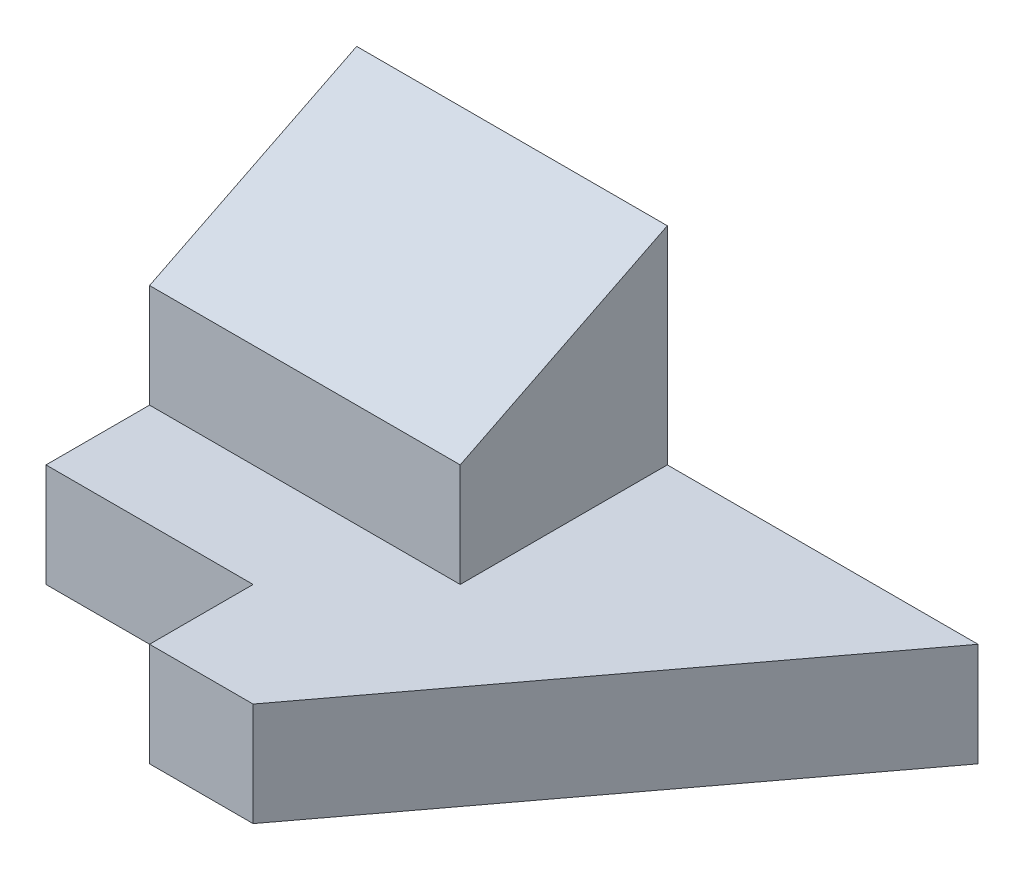
ISO-10303-21;
HEADER;
FILE_DESCRIPTION(('STEP AP214'),'2;1');
FILE_NAME('part.step','',(''),(''),'','','');
FILE_SCHEMA(('AUTOMOTIVE_DESIGN { 1 0 10303 214 1 1 1 1 }'));
ENDSEC;
DATA;
#1=APPLICATION_CONTEXT('core data for automotive mechanical design processes');
#2=APPLICATION_PROTOCOL_DEFINITION('international standard','automotive_design',2000,#1);
#3=PRODUCT_CONTEXT('',#1,'mechanical');
#4=PRODUCT('Part','Part','',(#3));
#5=PRODUCT_RELATED_PRODUCT_CATEGORY('part','',(#4));
#6=PRODUCT_DEFINITION_FORMATION('','',#4);
#7=PRODUCT_DEFINITION_CONTEXT('part definition',#1,'design');
#8=PRODUCT_DEFINITION('design','',#6,#7);
#9=PRODUCT_DEFINITION_SHAPE('','',#8);
#10=(LENGTH_UNIT() NAMED_UNIT(*) SI_UNIT(.MILLI.,.METRE.));
#11=(NAMED_UNIT(*) PLANE_ANGLE_UNIT() SI_UNIT($,.RADIAN.));
#12=(NAMED_UNIT(*) SI_UNIT($,.STERADIAN.) SOLID_ANGLE_UNIT());
#13=UNCERTAINTY_MEASURE_WITH_UNIT(LENGTH_MEASURE(1.E-05),#10,'distance_accuracy_value','');
#14=(GEOMETRIC_REPRESENTATION_CONTEXT(3) GLOBAL_UNCERTAINTY_ASSIGNED_CONTEXT((#13)) GLOBAL_UNIT_ASSIGNED_CONTEXT((#10,
#11,#12)) REPRESENTATION_CONTEXT('',''));
#15=CARTESIAN_POINT('',(0.,0.,0.));
#16=DIRECTION('',(0.,0.,1.));
#17=DIRECTION('',(1.,0.,0.));
#18=AXIS2_PLACEMENT_3D('',#15,#16,#17);
#19=CARTESIAN_POINT('',(-3.44,4.84,-4.72));
#20=DIRECTION('',(0.,0.,-1.));
#21=DIRECTION('',(-1.,0.,0.));
#22=AXIS2_PLACEMENT_3D('',#19,#20,#21);
#23=PLANE('',#22);
#24=DIRECTION('',(0.,-1.,0.));
#25=VECTOR('',#24,1.);
#26=CARTESIAN_POINT('',(-0.440000000000004,4.84,-4.72));
#27=LINE('',#26,#25);
#28=CARTESIAN_POINT('',(-0.440000000000004,4.84,-4.72));
#29=VERTEX_POINT('',#28);
#30=CARTESIAN_POINT('',(-0.440000000000004,3.84,-4.72));
#31=VERTEX_POINT('',#30);
#32=EDGE_CURVE('E136',#29,#31,#27,.T.);
#33=ORIENTED_EDGE('',*,*,#32,.T.);
#34=DIRECTION('',(1.,0.,0.));
#35=VECTOR('',#34,1.);
#36=CARTESIAN_POINT('',(-3.44,3.84,-4.72));
#37=LINE('',#36,#35);
#38=CARTESIAN_POINT('',(-6.44,3.84,-4.72));
#39=VERTEX_POINT('',#38);
#40=EDGE_CURVE('E89',#39,#31,#37,.T.);
#41=ORIENTED_EDGE('',*,*,#40,.F.);
#42=DIRECTION('',(0.,-1.,0.));
#43=VECTOR('',#42,1.);
#44=CARTESIAN_POINT('',(-6.44,4.84,-4.72));
#45=LINE('',#44,#43);
#46=CARTESIAN_POINT('',(-6.44,6.84,-4.72));
#47=VERTEX_POINT('',#46);
#48=EDGE_CURVE('E11',#47,#39,#45,.T.);
#49=ORIENTED_EDGE('',*,*,#48,.F.);
#50=DIRECTION('',(1.,0.,0.));
#51=VECTOR('',#50,1.);
#52=CARTESIAN_POINT('',(-3.44,6.84,-4.72));
#53=LINE('',#52,#51);
#54=CARTESIAN_POINT('',(-3.44,6.84,-4.72));
#55=VERTEX_POINT('',#54);
#56=EDGE_CURVE('E179',#47,#55,#53,.T.);
#57=ORIENTED_EDGE('',*,*,#56,.T.);
#58=DIRECTION('',(0.,-1.,0.));
#59=VECTOR('',#58,1.);
#60=CARTESIAN_POINT('',(-3.44,6.84,-4.72));
#61=LINE('',#60,#59);
#62=CARTESIAN_POINT('',(-3.44,4.84,-4.72));
#63=VERTEX_POINT('',#62);
#64=EDGE_CURVE('E173',#55,#63,#61,.T.);
#65=ORIENTED_EDGE('',*,*,#64,.T.);
#66=DIRECTION('',(1.,0.,0.));
#67=VECTOR('',#66,1.);
#68=CARTESIAN_POINT('',(-3.44,4.84,-4.72));
#69=LINE('',#68,#67);
#70=EDGE_CURVE('E61',#63,#29,#69,.T.);
#71=ORIENTED_EDGE('',*,*,#70,.T.);
#72=EDGE_LOOP('',(#33,#41,#49,#57,#65,#71));
#73=FACE_BOUND('',#72,.T.);
#74=ADVANCED_FACE('F38',(#73),#23,.T.);
#75=CARTESIAN_POINT('',(-6.44,4.84,-2.72));
#76=DIRECTION('',(-1.,0.,0.));
#77=DIRECTION('',(0.,0.,1.));
#78=AXIS2_PLACEMENT_3D('',#75,#76,#77);
#79=PLANE('',#78);
#80=DIRECTION('',(0.,0.447213595499958,-0.894427190999916));
#81=VECTOR('',#80,1.);
#82=CARTESIAN_POINT('',(-6.44,6.84,-4.72));
#83=LINE('',#82,#81);
#84=CARTESIAN_POINT('',(-6.44,5.84,-2.72));
#85=VERTEX_POINT('',#84);
#86=EDGE_CURVE('E161',#85,#47,#83,.T.);
#87=ORIENTED_EDGE('',*,*,#86,.T.);
#88=ORIENTED_EDGE('',*,*,#48,.T.);
#89=DIRECTION('',(0.,0.,-1.));
#90=VECTOR('',#89,1.);
#91=CARTESIAN_POINT('',(-6.44,3.84,-2.72));
#92=LINE('',#91,#90);
#93=CARTESIAN_POINT('',(-6.44,3.84,-1.72));
#94=VERTEX_POINT('',#93);
#95=EDGE_CURVE('E138',#94,#39,#92,.T.);
#96=ORIENTED_EDGE('',*,*,#95,.F.);
#97=DIRECTION('',(0.,-1.,0.));
#98=VECTOR('',#97,1.);
#99=CARTESIAN_POINT('',(-6.44,4.84,-1.72));
#100=LINE('',#99,#98);
#101=CARTESIAN_POINT('',(-6.44,4.84,-1.72));
#102=VERTEX_POINT('',#101);
#103=EDGE_CURVE('E45',#102,#94,#100,.T.);
#104=ORIENTED_EDGE('',*,*,#103,.F.);
#105=DIRECTION('',(0.,0.,-1.));
#106=VECTOR('',#105,1.);
#107=CARTESIAN_POINT('',(-6.44,4.84,-2.72));
#108=LINE('',#107,#106);
#109=CARTESIAN_POINT('',(-6.44,4.84,-2.72));
#110=VERTEX_POINT('',#109);
#111=EDGE_CURVE('E131',#102,#110,#108,.T.);
#112=ORIENTED_EDGE('',*,*,#111,.T.);
#113=DIRECTION('',(0.,-1.,0.));
#114=VECTOR('',#113,1.);
#115=CARTESIAN_POINT('',(-6.44,6.84,-2.72));
#116=LINE('',#115,#114);
#117=EDGE_CURVE('E52',#85,#110,#116,.T.);
#118=ORIENTED_EDGE('',*,*,#117,.F.);
#119=EDGE_LOOP('',(#87,#88,#96,#104,#112,#118));
#120=FACE_BOUND('',#119,.T.);
#121=ADVANCED_FACE('F157',(#120),#79,.T.);
#122=CARTESIAN_POINT('',(-3.44,4.84,-1.72));
#123=DIRECTION('',(0.,0.,-1.));
#124=DIRECTION('',(-1.,0.,0.));
#125=AXIS2_PLACEMENT_3D('',#122,#123,#124);
#126=PLANE('',#125);
#127=DIRECTION('',(1.,0.,0.));
#128=VECTOR('',#127,1.);
#129=CARTESIAN_POINT('',(-3.44,3.84,-1.72));
#130=LINE('',#129,#128);
#131=CARTESIAN_POINT('',(-4.44,3.84,-1.72));
#132=VERTEX_POINT('',#131);
#133=EDGE_CURVE('E141',#94,#132,#130,.T.);
#134=ORIENTED_EDGE('',*,*,#133,.T.);
#135=DIRECTION('',(0.,-1.,0.));
#136=VECTOR('',#135,1.);
#137=CARTESIAN_POINT('',(-4.44,4.84,-1.72));
#138=LINE('',#137,#136);
#139=CARTESIAN_POINT('',(-4.44,4.84,-1.72));
#140=VERTEX_POINT('',#139);
#141=EDGE_CURVE('E114',#140,#132,#138,.T.);
#142=ORIENTED_EDGE('',*,*,#141,.F.);
#143=DIRECTION('',(1.,0.,0.));
#144=VECTOR('',#143,1.);
#145=CARTESIAN_POINT('',(-3.44,4.84,-1.72));
#146=LINE('',#145,#144);
#147=EDGE_CURVE('E128',#102,#140,#146,.T.);
#148=ORIENTED_EDGE('',*,*,#147,.F.);
#149=ORIENTED_EDGE('',*,*,#103,.T.);
#150=EDGE_LOOP('',(#134,#142,#148,#149));
#151=FACE_BOUND('',#150,.T.);
#152=ADVANCED_FACE('F154',(#151),#126,.F.);
#153=CARTESIAN_POINT('',(-4.44,4.84,-2.72));
#154=DIRECTION('',(-1.,0.,0.));
#155=DIRECTION('',(0.,0.,1.));
#156=AXIS2_PLACEMENT_3D('',#153,#154,#155);
#157=PLANE('',#156);
#158=DIRECTION('',(0.,0.,-1.));
#159=VECTOR('',#158,1.);
#160=CARTESIAN_POINT('',(-4.44,3.84,-2.72));
#161=LINE('',#160,#159);
#162=CARTESIAN_POINT('',(-4.44,3.84,-0.719999999999997));
#163=VERTEX_POINT('',#162);
#164=EDGE_CURVE('E111',#163,#132,#161,.T.);
#165=ORIENTED_EDGE('',*,*,#164,.F.);
#166=DIRECTION('',(0.,-1.,0.));
#167=VECTOR('',#166,1.);
#168=CARTESIAN_POINT('',(-4.44,4.84,-0.719999999999997));
#169=LINE('',#168,#167);
#170=CARTESIAN_POINT('',(-4.44,4.84,-0.719999999999997));
#171=VERTEX_POINT('',#170);
#172=EDGE_CURVE('E105',#171,#163,#169,.T.);
#173=ORIENTED_EDGE('',*,*,#172,.F.);
#174=DIRECTION('',(0.,0.,-1.));
#175=VECTOR('',#174,1.);
#176=CARTESIAN_POINT('',(-4.44,4.84,-2.72));
#177=LINE('',#176,#175);
#178=EDGE_CURVE('E109',#171,#140,#177,.T.);
#179=ORIENTED_EDGE('',*,*,#178,.T.);
#180=ORIENTED_EDGE('',*,*,#141,.T.);
#181=EDGE_LOOP('',(#165,#173,#179,#180));
#182=FACE_BOUND('',#181,.T.);
#183=ADVANCED_FACE('F107',(#182),#157,.T.);
#184=CARTESIAN_POINT('',(-3.44,4.84,-0.719999999999997));
#185=DIRECTION('',(0.,0.,-1.));
#186=DIRECTION('',(-1.,0.,0.));
#187=AXIS2_PLACEMENT_3D('',#184,#185,#186);
#188=PLANE('',#187);
#189=DIRECTION('',(1.,0.,0.));
#190=VECTOR('',#189,1.);
#191=CARTESIAN_POINT('',(-3.44,3.84,-0.719999999999997));
#192=LINE('',#191,#190);
#193=CARTESIAN_POINT('',(-3.44,3.84,-0.719999999999997));
#194=VERTEX_POINT('',#193);
#195=EDGE_CURVE('E145',#163,#194,#192,.T.);
#196=ORIENTED_EDGE('',*,*,#195,.T.);
#197=DIRECTION('',(0.,-1.,0.));
#198=VECTOR('',#197,1.);
#199=CARTESIAN_POINT('',(-3.44,4.84,-0.719999999999997));
#200=LINE('',#199,#198);
#201=CARTESIAN_POINT('',(-3.44,4.84,-0.719999999999997));
#202=VERTEX_POINT('',#201);
#203=EDGE_CURVE('E115',#202,#194,#200,.T.);
#204=ORIENTED_EDGE('',*,*,#203,.F.);
#205=DIRECTION('',(1.,0.,0.));
#206=VECTOR('',#205,1.);
#207=CARTESIAN_POINT('',(-3.44,4.84,-0.719999999999997));
#208=LINE('',#207,#206);
#209=EDGE_CURVE('E118',#171,#202,#208,.T.);
#210=ORIENTED_EDGE('',*,*,#209,.F.);
#211=ORIENTED_EDGE('',*,*,#172,.T.);
#212=EDGE_LOOP('',(#196,#204,#210,#211));
#213=FACE_BOUND('',#212,.T.);
#214=ADVANCED_FACE('F119',(#213),#188,.F.);
#215=CARTESIAN_POINT('',(-2.48,4.84,-2.));
#216=DIRECTION('',(-0.8,0.,-0.6));
#217=DIRECTION('',(-0.6,0.,0.8));
#218=AXIS2_PLACEMENT_3D('',#215,#216,#217);
#219=PLANE('',#218);
#220=DIRECTION('',(0.6,0.,-0.8));
#221=VECTOR('',#220,1.);
#222=CARTESIAN_POINT('',(-2.48,3.84,-2.));
#223=LINE('',#222,#221);
#224=EDGE_CURVE('E147',#194,#31,#223,.T.);
#225=ORIENTED_EDGE('',*,*,#224,.T.);
#226=ORIENTED_EDGE('',*,*,#32,.F.);
#227=DIRECTION('',(0.6,0.,-0.8));
#228=VECTOR('',#227,1.);
#229=CARTESIAN_POINT('',(-2.48,4.84,-2.));
#230=LINE('',#229,#228);
#231=EDGE_CURVE('E123',#202,#29,#230,.T.);
#232=ORIENTED_EDGE('',*,*,#231,.F.);
#233=ORIENTED_EDGE('',*,*,#203,.T.);
#234=EDGE_LOOP('',(#225,#226,#232,#233));
#235=FACE_BOUND('',#234,.T.);
#236=ADVANCED_FACE('F165',(#235),#219,.F.);
#237=CARTESIAN_POINT('',(-3.44,4.84,-2.72));
#238=DIRECTION('',(0.,1.,0.));
#239=DIRECTION('',(0.,0.,1.));
#240=AXIS2_PLACEMENT_3D('',#237,#238,#239);
#241=PLANE('',#240);
#242=DIRECTION('',(0.,0.,-1.));
#243=VECTOR('',#242,1.);
#244=CARTESIAN_POINT('',(-3.44,4.84,-2.72));
#245=LINE('',#244,#243);
#246=CARTESIAN_POINT('',(-3.44,4.84,-2.72));
#247=VERTEX_POINT('',#246);
#248=EDGE_CURVE('E139',#247,#63,#245,.T.);
#249=ORIENTED_EDGE('',*,*,#248,.F.);
#250=DIRECTION('',(-1.,0.,0.));
#251=VECTOR('',#250,1.);
#252=CARTESIAN_POINT('',(-3.44,4.84,-2.72));
#253=LINE('',#252,#251);
#254=EDGE_CURVE('E171',#247,#110,#253,.T.);
#255=ORIENTED_EDGE('',*,*,#254,.T.);
#256=ORIENTED_EDGE('',*,*,#111,.F.);
#257=ORIENTED_EDGE('',*,*,#147,.T.);
#258=ORIENTED_EDGE('',*,*,#178,.F.);
#259=ORIENTED_EDGE('',*,*,#209,.T.);
#260=ORIENTED_EDGE('',*,*,#231,.T.);
#261=ORIENTED_EDGE('',*,*,#70,.F.);
#262=EDGE_LOOP('',(#249,#255,#256,#257,#258,#259,#260,#261));
#263=FACE_BOUND('',#262,.T.);
#264=ADVANCED_FACE('F126',(#263),#241,.T.);
#265=CARTESIAN_POINT('',(-3.44,3.84,-2.72));
#266=DIRECTION('',(0.,1.,0.));
#267=DIRECTION('',(0.,0.,1.));
#268=AXIS2_PLACEMENT_3D('',#265,#266,#267);
#269=PLANE('',#268);
#270=ORIENTED_EDGE('',*,*,#40,.T.);
#271=ORIENTED_EDGE('',*,*,#224,.F.);
#272=ORIENTED_EDGE('',*,*,#195,.F.);
#273=ORIENTED_EDGE('',*,*,#164,.T.);
#274=ORIENTED_EDGE('',*,*,#133,.F.);
#275=ORIENTED_EDGE('',*,*,#95,.T.);
#276=EDGE_LOOP('',(#270,#271,#272,#273,#274,#275));
#277=FACE_BOUND('',#276,.T.);
#278=ADVANCED_FACE('F155',(#277),#269,.F.);
#279=CARTESIAN_POINT('',(-3.44,6.84,-2.72));
#280=DIRECTION('',(1.,0.,0.));
#281=DIRECTION('',(0.,0.,-1.));
#282=AXIS2_PLACEMENT_3D('',#279,#280,#281);
#283=PLANE('',#282);
#284=DIRECTION('',(0.,0.447213595499958,-0.894427190999916));
#285=VECTOR('',#284,1.);
#286=CARTESIAN_POINT('',(-3.44,6.84,-4.72));
#287=LINE('',#286,#285);
#288=CARTESIAN_POINT('',(-3.44,5.84,-2.72));
#289=VERTEX_POINT('',#288);
#290=EDGE_CURVE('E184',#289,#55,#287,.T.);
#291=ORIENTED_EDGE('',*,*,#290,.F.);
#292=DIRECTION('',(0.,-1.,0.));
#293=VECTOR('',#292,1.);
#294=CARTESIAN_POINT('',(-3.44,6.84,-2.72));
#295=LINE('',#294,#293);
#296=EDGE_CURVE('E176',#289,#247,#295,.T.);
#297=ORIENTED_EDGE('',*,*,#296,.T.);
#298=ORIENTED_EDGE('',*,*,#248,.T.);
#299=ORIENTED_EDGE('',*,*,#64,.F.);
#300=EDGE_LOOP('',(#291,#297,#298,#299));
#301=FACE_BOUND('',#300,.T.);
#302=ADVANCED_FACE('F197',(#301),#283,.T.);
#303=CARTESIAN_POINT('',(-3.44,6.84,-2.72));
#304=DIRECTION('',(0.,0.,-1.));
#305=DIRECTION('',(-1.,0.,0.));
#306=AXIS2_PLACEMENT_3D('',#303,#304,#305);
#307=PLANE('',#306);
#308=ORIENTED_EDGE('',*,*,#296,.F.);
#309=DIRECTION('',(1.,0.,0.));
#310=VECTOR('',#309,1.);
#311=CARTESIAN_POINT('',(-6.44,5.84,-2.72));
#312=LINE('',#311,#310);
#313=EDGE_CURVE('E181',#85,#289,#312,.T.);
#314=ORIENTED_EDGE('',*,*,#313,.F.);
#315=ORIENTED_EDGE('',*,*,#117,.T.);
#316=ORIENTED_EDGE('',*,*,#254,.F.);
#317=EDGE_LOOP('',(#308,#314,#315,#316));
#318=FACE_BOUND('',#317,.T.);
#319=ADVANCED_FACE('F198',(#318),#307,.F.);
#320=CARTESIAN_POINT('',(-6.44,6.84,-4.72));
#321=DIRECTION('',(0.,-0.894427190999916,-0.447213595499958));
#322=DIRECTION('',(0.,0.447213595499958,-0.894427190999916));
#323=AXIS2_PLACEMENT_3D('',#320,#321,#322);
#324=PLANE('',#323);
#325=ORIENTED_EDGE('',*,*,#290,.T.);
#326=ORIENTED_EDGE('',*,*,#56,.F.);
#327=ORIENTED_EDGE('',*,*,#86,.F.);
#328=ORIENTED_EDGE('',*,*,#313,.T.);
#329=EDGE_LOOP('',(#325,#326,#327,#328));
#330=FACE_BOUND('',#329,.T.);
#331=ADVANCED_FACE('F192',(#330),#324,.F.);
#332=CLOSED_SHELL('',(#74,#121,#152,#183,#214,#236,#264,#278,#302,#319,#331));
#333=MANIFOLD_SOLID_BREP('B2',#332);
#334=ADVANCED_BREP_SHAPE_REPRESENTATION('',(#18,#333),#14);
#335=SHAPE_DEFINITION_REPRESENTATION(#9,#334);
ENDSEC;
END-ISO-10303-21;
